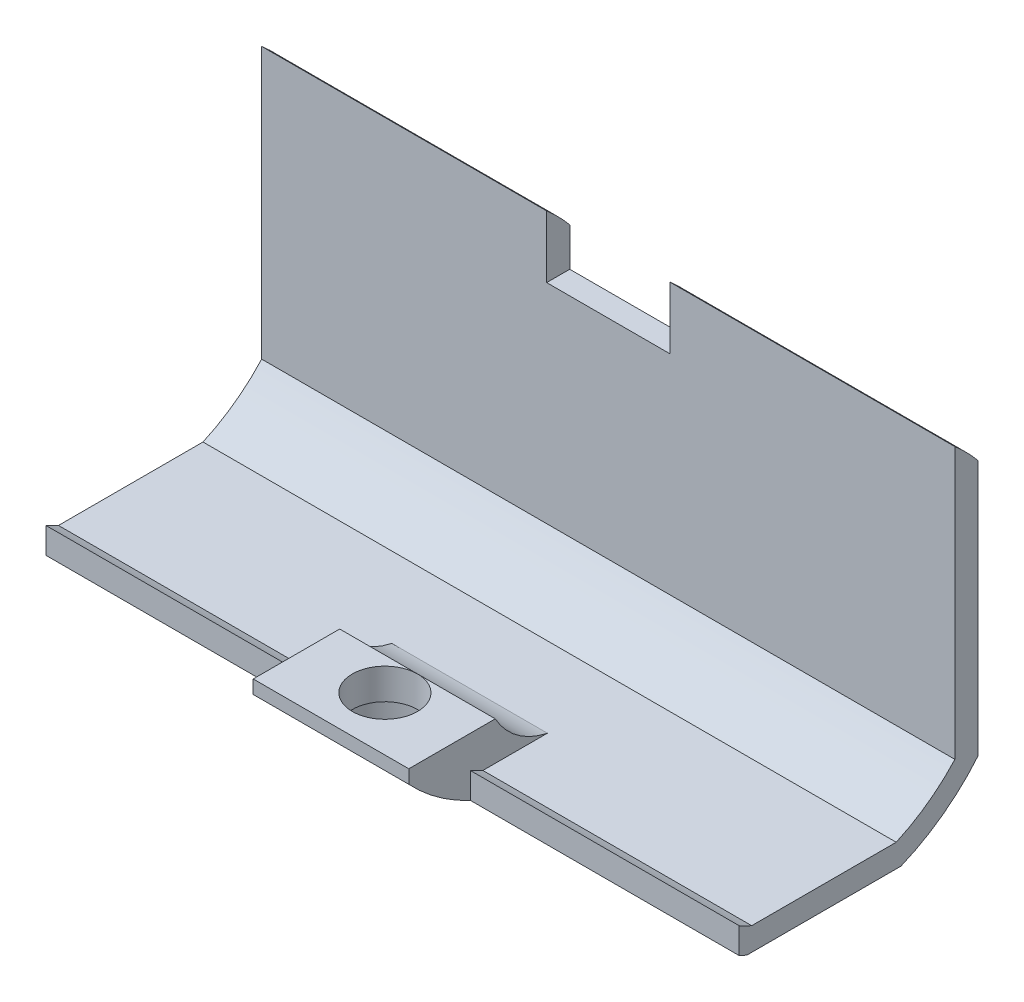
ISO-10303-21;
HEADER;
FILE_DESCRIPTION(('STEP AP214'),'2;1');
FILE_NAME('part.step','',(''),(''),'','','');
FILE_SCHEMA(('AUTOMOTIVE_DESIGN { 1 0 10303 214 1 1 1 1 }'));
ENDSEC;
DATA;
#1=APPLICATION_CONTEXT('core data for automotive mechanical design processes');
#2=APPLICATION_PROTOCOL_DEFINITION('international standard','automotive_design',2000,#1);
#3=PRODUCT_CONTEXT('',#1,'mechanical');
#4=PRODUCT('Part','Part','',(#3));
#5=PRODUCT_RELATED_PRODUCT_CATEGORY('part','',(#4));
#6=PRODUCT_DEFINITION_FORMATION('','',#4);
#7=PRODUCT_DEFINITION_CONTEXT('part definition',#1,'design');
#8=PRODUCT_DEFINITION('design','',#6,#7);
#9=PRODUCT_DEFINITION_SHAPE('','',#8);
#10=(LENGTH_UNIT() NAMED_UNIT(*) SI_UNIT(.MILLI.,.METRE.));
#11=(NAMED_UNIT(*) PLANE_ANGLE_UNIT() SI_UNIT($,.RADIAN.));
#12=(NAMED_UNIT(*) SI_UNIT($,.STERADIAN.) SOLID_ANGLE_UNIT());
#13=UNCERTAINTY_MEASURE_WITH_UNIT(LENGTH_MEASURE(1.E-05),#10,'distance_accuracy_value','');
#14=(GEOMETRIC_REPRESENTATION_CONTEXT(3) GLOBAL_UNCERTAINTY_ASSIGNED_CONTEXT((#13)) GLOBAL_UNIT_ASSIGNED_CONTEXT((#10,
#11,#12)) REPRESENTATION_CONTEXT('',''));
#15=CARTESIAN_POINT('',(0.,0.,0.));
#16=DIRECTION('',(0.,0.,1.));
#17=DIRECTION('',(1.,0.,0.));
#18=AXIS2_PLACEMENT_3D('',#15,#16,#17);
#19=CARTESIAN_POINT('',(2.37881348329814E-13,-63.4792189913841,-4.00000000008991));
#20=DIRECTION('',(0.,1.,1.41635314587774E-12));
#21=DIRECTION('',(1.,0.,0.));
#22=AXIS2_PLACEMENT_3D('',#19,#20,#21);
#23=CYLINDRICAL_SURFACE('',#22,2.115);
#24=CARTESIAN_POINT('',(2.23706429623324E-13,-59.7000000019943,-4.00000000008456));
#25=DIRECTION('',(0.,-1.,-1.41635314587774E-12));
#26=DIRECTION('',(-1.,0.,0.));
#27=AXIS2_PLACEMENT_3D('',#24,#25,#26);
#28=CIRCLE('',#27,2.115);
#29=CARTESIAN_POINT('',(2.23779328401008E-13,-59.7000000019913,-6.11500000008456));
#30=VERTEX_POINT('',#29);
#31=EDGE_CURVE('E213',#30,#30,#28,.T.);
#32=ORIENTED_EDGE('',*,*,#31,.F.);
#33=EDGE_LOOP('',(#32));
#34=FACE_BOUND('',#33,.T.);
#35=CARTESIAN_POINT('',(2.31207936546467E-13,-61.7000000019944,-4.00000000008739));
#36=DIRECTION('',(0.,-1.,-1.41635314587774E-12));
#37=DIRECTION('',(0.,1.41635314587774E-12,-1.));
#38=AXIS2_PLACEMENT_3D('',#35,#36,#37);
#39=CIRCLE('',#38,2.115);
#40=CARTESIAN_POINT('',(2.31207936546467E-13,-61.7000000019914,-6.11500000008739));
#41=VERTEX_POINT('',#40);
#42=EDGE_CURVE('E333',#41,#41,#39,.T.);
#43=ORIENTED_EDGE('',*,*,#42,.T.);
#44=EDGE_LOOP('',(#43));
#45=FACE_BOUND('',#44,.T.);
#46=ADVANCED_FACE('F36',(#34,#45),#23,.F.);
#47=CARTESIAN_POINT('',(-22.5,-51.7000000019859,-10.0000000000732));
#48=DIRECTION('',(1.,0.,0.));
#49=DIRECTION('',(0.,-1.,-1.41635314587774E-12));
#50=AXIS2_PLACEMENT_3D('',#47,#48,#49);
#51=CYLINDRICAL_SURFACE('',#50,13.);
#52=DIRECTION('',(1.,0.,0.));
#53=VECTOR('',#52,1.);
#54=CARTESIAN_POINT('',(-22.5,-43.3933761390536,-20.0000000000615));
#55=LINE('',#54,#53);
#56=CARTESIAN_POINT('',(4.,-43.3933761390536,-20.0000000000615));
#57=VERTEX_POINT('',#56);
#58=CARTESIAN_POINT('',(22.5,-43.3933761390536,-20.0000000000615));
#59=VERTEX_POINT('',#58);
#60=EDGE_CURVE('E288',#57,#59,#55,.T.);
#61=ORIENTED_EDGE('',*,*,#60,.F.);
#62=CARTESIAN_POINT('',(4.,-51.7000000019859,-10.0000000000732));
#63=DIRECTION('',(1.,0.,0.));
#64=DIRECTION('',(0.,-1.41635314587774E-12,1.));
#65=AXIS2_PLACEMENT_3D('',#62,#63,#64);
#66=CIRCLE('',#65,13.);
#67=CARTESIAN_POINT('',(4.,-41.8638422155208,-18.5000000000593));
#68=VERTEX_POINT('',#67);
#69=EDGE_CURVE('E469',#57,#68,#66,.T.);
#70=ORIENTED_EDGE('',*,*,#69,.T.);
#71=DIRECTION('',(1.,0.,0.));
#72=VECTOR('',#71,1.);
#73=CARTESIAN_POINT('',(-22.5,-41.8638422155208,-18.5000000000593));
#74=LINE('',#73,#72);
#75=CARTESIAN_POINT('',(22.5,-41.8638422155208,-18.5000000000593));
#76=VERTEX_POINT('',#75);
#77=EDGE_CURVE('E292',#68,#76,#74,.T.);
#78=ORIENTED_EDGE('',*,*,#77,.T.);
#79=CARTESIAN_POINT('',(22.5,-51.7000000019859,-10.0000000000732));
#80=DIRECTION('',(-1.,0.,0.));
#81=DIRECTION('',(0.,1.,1.41635314587774E-12));
#82=AXIS2_PLACEMENT_3D('',#79,#80,#81);
#83=CIRCLE('',#82,13.);
#84=EDGE_CURVE('E282',#76,#59,#83,.T.);
#85=ORIENTED_EDGE('',*,*,#84,.T.);
#86=EDGE_LOOP('',(#61,#70,#78,#85));
#87=FACE_BOUND('',#86,.T.);
#88=ADVANCED_FACE('F373',(#87),#51,.T.);
#89=CARTESIAN_POINT('',(-22.5,-63.4792189913834,-4.50000000008991));
#90=DIRECTION('',(0.,1.41635314587774E-12,-1.));
#91=DIRECTION('',(1.,0.,0.));
#92=AXIS2_PLACEMENT_3D('',#89,#90,#91);
#93=PLANE('',#92);
#94=DIRECTION('',(0.,1.,1.41635314587774E-12));
#95=VECTOR('',#94,1.);
#96=CARTESIAN_POINT('',(5.04999999999999,-63.4792189913833,-4.50000000008991));
#97=LINE('',#96,#95);
#98=CARTESIAN_POINT('',(5.04999999999999,-63.4792189913834,-4.50000000008992));
#99=VERTEX_POINT('',#98);
#100=CARTESIAN_POINT('',(5.04999999999998,-61.7995049403558,-4.50000000008753));
#101=VERTEX_POINT('',#100);
#102=EDGE_CURVE('E234',#99,#101,#97,.T.);
#103=ORIENTED_EDGE('',*,*,#102,.F.);
#104=DIRECTION('',(1.,0.,0.));
#105=VECTOR('',#104,1.);
#106=CARTESIAN_POINT('',(-22.5,-63.4792189913834,-4.50000000008991));
#107=LINE('',#106,#105);
#108=CARTESIAN_POINT('',(22.5,-63.4792189913834,-4.50000000008991));
#109=VERTEX_POINT('',#108);
#110=EDGE_CURVE('E310',#99,#109,#107,.T.);
#111=ORIENTED_EDGE('',*,*,#110,.T.);
#112=DIRECTION('',(0.,1.,1.41635314587774E-12));
#113=VECTOR('',#112,1.);
#114=CARTESIAN_POINT('',(22.5,-63.4792189913834,-4.50000000008991));
#115=LINE('',#114,#113);
#116=CARTESIAN_POINT('',(22.5,-61.7995049403558,-4.50000000008753));
#117=VERTEX_POINT('',#116);
#118=EDGE_CURVE('E268',#109,#117,#115,.T.);
#119=ORIENTED_EDGE('',*,*,#118,.T.);
#120=DIRECTION('',(1.,0.,0.));
#121=VECTOR('',#120,1.);
#122=CARTESIAN_POINT('',(-22.5,-61.7995049403557,-4.50000000008753));
#123=LINE('',#122,#121);
#124=EDGE_CURVE('E306',#101,#117,#123,.T.);
#125=ORIENTED_EDGE('',*,*,#124,.F.);
#126=EDGE_LOOP('',(#103,#111,#119,#125));
#127=FACE_BOUND('',#126,.T.);
#128=ADVANCED_FACE('F419',(#127),#93,.F.);
#129=DIRECTION('',(0.,-1.,-1.41635314587774E-12));
#130=VECTOR('',#129,1.);
#131=CARTESIAN_POINT('',(-5.05000000000001,-63.4792189913834,-4.50000000008991));
#132=LINE('',#131,#130);
#133=CARTESIAN_POINT('',(-5.05000000000002,-61.7995049403557,-4.50000000008753));
#134=VERTEX_POINT('',#133);
#135=CARTESIAN_POINT('',(-5.05000000000001,-63.4792189913835,-4.50000000008991));
#136=VERTEX_POINT('',#135);
#137=EDGE_CURVE('E229',#134,#136,#132,.T.);
#138=ORIENTED_EDGE('',*,*,#137,.F.);
#139=CARTESIAN_POINT('',(-22.5,-61.7995049403557,-4.50000000008753));
#140=VERTEX_POINT('',#139);
#141=EDGE_CURVE('E307',#140,#134,#123,.T.);
#142=ORIENTED_EDGE('',*,*,#141,.F.);
#143=DIRECTION('',(0.,1.,1.41635314587774E-12));
#144=VECTOR('',#143,1.);
#145=CARTESIAN_POINT('',(-22.5,-63.4792189913834,-4.50000000008991));
#146=LINE('',#145,#144);
#147=CARTESIAN_POINT('',(-22.5,-63.4792189913834,-4.50000000008991));
#148=VERTEX_POINT('',#147);
#149=EDGE_CURVE('E245',#148,#140,#146,.T.);
#150=ORIENTED_EDGE('',*,*,#149,.F.);
#151=EDGE_CURVE('E311',#148,#136,#107,.T.);
#152=ORIENTED_EDGE('',*,*,#151,.T.);
#153=EDGE_LOOP('',(#138,#142,#150,#152));
#154=FACE_BOUND('',#153,.T.);
#155=ADVANCED_FACE('F417',(#154),#93,.F.);
#156=CARTESIAN_POINT('',(-22.5,-51.7000000019859,-10.0000000000732));
#157=DIRECTION('',(1.,0.,0.));
#158=DIRECTION('',(0.,-1.,-1.41635314587774E-12));
#159=AXIS2_PLACEMENT_3D('',#156,#157,#158);
#160=CYLINDRICAL_SURFACE('',#159,11.5);
#161=CARTESIAN_POINT('',(5.04999999999994,-51.7000000019859,-10.0000000000732));
#162=DIRECTION('',(-1.,0.,0.));
#163=DIRECTION('',(0.,1.,1.41635314587774E-12));
#164=AXIS2_PLACEMENT_3D('',#161,#162,#163);
#165=CIRCLE('',#164,11.5);
#166=CARTESIAN_POINT('',(5.04999999999999,-62.2000000019925,-5.30958424026466));
#167=VERTEX_POINT('',#166);
#168=EDGE_CURVE('E232',#101,#167,#165,.F.);
#169=ORIENTED_EDGE('',*,*,#168,.F.);
#170=ORIENTED_EDGE('',*,*,#124,.T.);
#171=CARTESIAN_POINT('',(22.5,-51.7000000019859,-10.0000000000732));
#172=DIRECTION('',(1.,0.,0.));
#173=DIRECTION('',(0.,1.,1.41635314587774E-12));
#174=AXIS2_PLACEMENT_3D('',#171,#172,#173);
#175=CIRCLE('',#174,11.5);
#176=CARTESIAN_POINT('',(22.5,-62.2000000019925,-5.30958424026466));
#177=VERTEX_POINT('',#176);
#178=EDGE_CURVE('E271',#117,#177,#175,.T.);
#179=ORIENTED_EDGE('',*,*,#178,.T.);
#180=DIRECTION('',(1.,0.,0.));
#181=VECTOR('',#180,1.);
#182=CARTESIAN_POINT('',(-22.5,-62.2000000019925,-5.30958424026466));
#183=LINE('',#182,#181);
#184=EDGE_CURVE('E302',#167,#177,#183,.T.);
#185=ORIENTED_EDGE('',*,*,#184,.F.);
#186=EDGE_LOOP('',(#169,#170,#179,#185));
#187=FACE_BOUND('',#186,.T.);
#188=ADVANCED_FACE('F415',(#187),#160,.F.);
#189=CARTESIAN_POINT('',(-5.05000000000006,-51.7000000019859,-10.0000000000732));
#190=DIRECTION('',(1.,0.,0.));
#191=DIRECTION('',(0.,-1.,-1.41635314587774E-12));
#192=AXIS2_PLACEMENT_3D('',#189,#190,#191);
#193=CIRCLE('',#192,11.5);
#194=CARTESIAN_POINT('',(-5.05000000000002,-62.2000000019925,-5.30958424026466));
#195=VERTEX_POINT('',#194);
#196=EDGE_CURVE('E227',#195,#134,#193,.F.);
#197=ORIENTED_EDGE('',*,*,#196,.F.);
#198=CARTESIAN_POINT('',(-22.5,-62.2000000019925,-5.30958424026466));
#199=VERTEX_POINT('',#198);
#200=EDGE_CURVE('E303',#199,#195,#183,.T.);
#201=ORIENTED_EDGE('',*,*,#200,.F.);
#202=CARTESIAN_POINT('',(-22.5,-51.7000000019859,-10.0000000000732));
#203=DIRECTION('',(1.,0.,0.));
#204=DIRECTION('',(0.,1.,1.41635314587774E-12));
#205=AXIS2_PLACEMENT_3D('',#202,#203,#204);
#206=CIRCLE('',#205,11.5);
#207=EDGE_CURVE('E247',#140,#199,#206,.T.);
#208=ORIENTED_EDGE('',*,*,#207,.F.);
#209=ORIENTED_EDGE('',*,*,#141,.T.);
#210=EDGE_LOOP('',(#197,#201,#208,#209));
#211=FACE_BOUND('',#210,.T.);
#212=ADVANCED_FACE('F413',(#211),#160,.F.);
#213=CARTESIAN_POINT('',(-22.5,-62.2000000019792,-14.6904157599115));
#214=DIRECTION('',(0.,-1.,-1.41635314587774E-12));
#215=DIRECTION('',(-1.,0.,0.));
#216=AXIS2_PLACEMENT_3D('',#213,#214,#215);
#217=PLANE('',#216);
#218=DIRECTION('',(0.,1.41635314587774E-12,-1.));
#219=VECTOR('',#218,1.);
#220=CARTESIAN_POINT('',(5.04999999999999,-62.2000000019792,-14.6904157599115));
#221=LINE('',#220,#219);
#222=CARTESIAN_POINT('',(5.04999999999952,-62.2000000019866,-9.5000000000881));
#223=VERTEX_POINT('',#222);
#224=EDGE_CURVE('E205',#167,#223,#221,.T.);
#225=ORIENTED_EDGE('',*,*,#224,.F.);
#226=ORIENTED_EDGE('',*,*,#184,.T.);
#227=DIRECTION('',(0.,1.41635314587774E-12,-1.));
#228=VECTOR('',#227,1.);
#229=CARTESIAN_POINT('',(22.5,-62.2000000019792,-14.6904157599115));
#230=LINE('',#229,#228);
#231=CARTESIAN_POINT('',(22.5,-62.2000000019792,-14.6904157599115));
#232=VERTEX_POINT('',#231);
#233=EDGE_CURVE('E274',#177,#232,#230,.T.);
#234=ORIENTED_EDGE('',*,*,#233,.T.);
#235=DIRECTION('',(1.,0.,0.));
#236=VECTOR('',#235,1.);
#237=CARTESIAN_POINT('',(-22.5,-62.2000000019792,-14.6904157599115));
#238=LINE('',#237,#236);
#239=CARTESIAN_POINT('',(-22.5,-62.2000000019792,-14.6904157599115));
#240=VERTEX_POINT('',#239);
#241=EDGE_CURVE('E299',#240,#232,#238,.T.);
#242=ORIENTED_EDGE('',*,*,#241,.F.);
#243=DIRECTION('',(0.,1.41635314587774E-12,-1.));
#244=VECTOR('',#243,1.);
#245=CARTESIAN_POINT('',(-22.5,-62.2000000019792,-14.6904157599115));
#246=LINE('',#245,#244);
#247=EDGE_CURVE('E249',#199,#240,#246,.T.);
#248=ORIENTED_EDGE('',*,*,#247,.F.);
#249=ORIENTED_EDGE('',*,*,#200,.T.);
#250=DIRECTION('',(0.,-1.41635314587774E-12,1.));
#251=VECTOR('',#250,1.);
#252=CARTESIAN_POINT('',(-5.05000000000002,-62.2000000019792,-14.6904157599115));
#253=LINE('',#252,#251);
#254=CARTESIAN_POINT('',(-5.05000000000001,-62.2000000019865,-9.5000000000881));
#255=VERTEX_POINT('',#254);
#256=EDGE_CURVE('E323',#255,#195,#253,.T.);
#257=ORIENTED_EDGE('',*,*,#256,.F.);
#258=DIRECTION('',(-1.,0.,0.));
#259=VECTOR('',#258,1.);
#260=CARTESIAN_POINT('',(-22.5,-62.2000000019866,-9.5000000000881));
#261=LINE('',#260,#259);
#262=EDGE_CURVE('E321',#223,#255,#261,.T.);
#263=ORIENTED_EDGE('',*,*,#262,.F.);
#264=EDGE_LOOP('',(#225,#226,#234,#242,#248,#249,#257,#263));
#265=FACE_BOUND('',#264,.T.);
#266=ADVANCED_FACE('F410',(#265),#217,.F.);
#267=CARTESIAN_POINT('',(-22.5,-51.7000000019859,-10.0000000000732));
#268=DIRECTION('',(1.,0.,0.));
#269=DIRECTION('',(0.,-1.,-1.41635314587774E-12));
#270=AXIS2_PLACEMENT_3D('',#267,#268,#269);
#271=CYLINDRICAL_SURFACE('',#270,13.);
#272=CARTESIAN_POINT('',(22.5,-51.7000000019859,-10.0000000000732));
#273=DIRECTION('',(-1.,0.,0.));
#274=DIRECTION('',(0.,1.,1.41635314587774E-12));
#275=AXIS2_PLACEMENT_3D('',#272,#273,#274);
#276=CIRCLE('',#275,13.);
#277=CARTESIAN_POINT('',(22.5,-60.0066238648898,-20.000000000085));
#278=VERTEX_POINT('',#277);
#279=CARTESIAN_POINT('',(22.5,-63.7000000019788,-15.0000000000902));
#280=VERTEX_POINT('',#279);
#281=EDGE_CURVE('E236',#278,#280,#276,.T.);
#282=ORIENTED_EDGE('',*,*,#281,.T.);
#283=DIRECTION('',(1.,0.,0.));
#284=VECTOR('',#283,1.);
#285=CARTESIAN_POINT('',(-22.5,-63.7000000019788,-15.0000000000902));
#286=LINE('',#285,#284);
#287=CARTESIAN_POINT('',(-22.5,-63.7000000019788,-15.0000000000902));
#288=VERTEX_POINT('',#287);
#289=EDGE_CURVE('E318',#288,#280,#286,.T.);
#290=ORIENTED_EDGE('',*,*,#289,.F.);
#291=CARTESIAN_POINT('',(-22.5,-51.7000000019859,-10.0000000000732));
#292=DIRECTION('',(-1.,0.,0.));
#293=DIRECTION('',(0.,1.,1.41635314587774E-12));
#294=AXIS2_PLACEMENT_3D('',#291,#292,#293);
#295=CIRCLE('',#294,13.);
#296=CARTESIAN_POINT('',(-22.5,-60.0066238648898,-20.000000000085));
#297=VERTEX_POINT('',#296);
#298=EDGE_CURVE('E237',#297,#288,#295,.T.);
#299=ORIENTED_EDGE('',*,*,#298,.F.);
#300=DIRECTION('',(1.,0.,0.));
#301=VECTOR('',#300,1.);
#302=CARTESIAN_POINT('',(-22.5,-60.0066238648898,-20.000000000085));
#303=LINE('',#302,#301);
#304=EDGE_CURVE('E259',#297,#278,#303,.T.);
#305=ORIENTED_EDGE('',*,*,#304,.T.);
#306=EDGE_LOOP('',(#282,#290,#299,#305));
#307=FACE_BOUND('',#306,.T.);
#308=ADVANCED_FACE('F38',(#307),#271,.T.);
#309=CARTESIAN_POINT('',(-22.5,-63.7000000019788,-15.0000000000902));
#310=DIRECTION('',(0.,1.,1.41635314587774E-12));
#311=DIRECTION('',(1.,0.,0.));
#312=AXIS2_PLACEMENT_3D('',#309,#310,#311);
#313=PLANE('',#312);
#314=DIRECTION('',(1.,0.,0.));
#315=VECTOR('',#314,1.);
#316=CARTESIAN_POINT('',(-22.5,-63.700000001993,-5.00000000009022));
#317=LINE('',#316,#315);
#318=CARTESIAN_POINT('',(3.35410196624992,-63.700000001993,-5.00000000009024));
#319=VERTEX_POINT('',#318);
#320=CARTESIAN_POINT('',(22.5,-63.700000001993,-5.00000000009022));
#321=VERTEX_POINT('',#320);
#322=EDGE_CURVE('E314',#319,#321,#317,.T.);
#323=ORIENTED_EDGE('',*,*,#322,.F.);
#324=CARTESIAN_POINT('',(2.37431225488313E-13,-63.7000000019944,-4.00000000009022));
#325=DIRECTION('',(0.,-1.,-1.41635314587774E-12));
#326=DIRECTION('',(0.,1.41635314587774E-12,-1.));
#327=AXIS2_PLACEMENT_3D('',#324,#325,#326);
#328=CIRCLE('',#327,3.5);
#329=CARTESIAN_POINT('',(-3.35410196624944,-63.700000001993,-5.00000000009024));
#330=VERTEX_POINT('',#329);
#331=EDGE_CURVE('E444',#330,#319,#328,.T.);
#332=ORIENTED_EDGE('',*,*,#331,.F.);
#333=CARTESIAN_POINT('',(-22.5,-63.700000001993,-5.00000000009022));
#334=VERTEX_POINT('',#333);
#335=EDGE_CURVE('E315',#334,#330,#317,.T.);
#336=ORIENTED_EDGE('',*,*,#335,.F.);
#337=DIRECTION('',(0.,-1.41635314587774E-12,1.));
#338=VECTOR('',#337,1.);
#339=CARTESIAN_POINT('',(-22.5,-63.7000000019788,-15.0000000000902));
#340=LINE('',#339,#338);
#341=EDGE_CURVE('E240',#288,#334,#340,.T.);
#342=ORIENTED_EDGE('',*,*,#341,.F.);
#343=ORIENTED_EDGE('',*,*,#289,.T.);
#344=DIRECTION('',(0.,-1.41635314587774E-12,1.));
#345=VECTOR('',#344,1.);
#346=CARTESIAN_POINT('',(22.5,-63.7000000019788,-15.0000000000902));
#347=LINE('',#346,#345);
#348=EDGE_CURVE('E262',#280,#321,#347,.T.);
#349=ORIENTED_EDGE('',*,*,#348,.T.);
#350=EDGE_LOOP('',(#323,#332,#336,#342,#343,#349));
#351=FACE_BOUND('',#350,.T.);
#352=ADVANCED_FACE('F489',(#351),#313,.F.);
#353=CARTESIAN_POINT('',(-22.5,-51.7000000019859,-10.0000000000732));
#354=DIRECTION('',(1.,0.,0.));
#355=DIRECTION('',(0.,-1.,-1.41635314587774E-12));
#356=AXIS2_PLACEMENT_3D('',#353,#354,#355);
#357=CYLINDRICAL_SURFACE('',#356,13.);
#358=ORIENTED_EDGE('',*,*,#335,.T.);
#359=CARTESIAN_POINT('',(-3.35410196624945,-63.700000001993,-5.00000000009021));
#360=CARTESIAN_POINT('',(-3.38491252068896,-63.6569758293769,-4.8966993478477));
#361=CARTESIAN_POINT('',(-3.41070285458632,-63.6120725182519,-4.79272912451755));
#362=CARTESIAN_POINT('',(-3.45248580917942,-63.5188318929799,-4.58445692628003));
#363=CARTESIAN_POINT('',(-3.46848619739377,-63.4704973353184,-4.48015528055376));
#364=CARTESIAN_POINT('',(-3.49091383660567,-63.3709434121477,-4.27267369589358));
#365=CARTESIAN_POINT('',(-3.49739694535936,-63.3197427249463,-4.16949076885916));
#366=CARTESIAN_POINT('',(-3.50132254448056,-63.2145466039672,-3.96439540080032));
#367=CARTESIAN_POINT('',(-3.49876339208037,-63.1605506641134,-3.86248319401147));
#368=CARTESIAN_POINT('',(-3.47812307715941,-62.9952825831939,-3.56035821140889));
#369=CARTESIAN_POINT('',(-3.44716245054076,-62.8803279101556,-3.36291940305222));
#370=CARTESIAN_POINT('',(-3.35373600695524,-62.643613552784,-2.97943749935646));
#371=CARTESIAN_POINT('',(-3.2911971584328,-62.5218386783289,-2.79342194644323));
#372=CARTESIAN_POINT('',(-3.17800990863783,-62.3405406276482,-2.53077044469164));
#373=CARTESIAN_POINT('',(-3.13857360776398,-62.2821653939529,-2.44832941766656));
#374=CARTESIAN_POINT('',(-3.0534768913529,-62.1651097445003,-2.28693313253666));
#375=CARTESIAN_POINT('',(-3.00781683964089,-62.1064293467749,-2.20797767103113));
#376=CARTESIAN_POINT('',(-2.91062412061863,-61.9894115198998,-2.05410089198643));
#377=CARTESIAN_POINT('',(-2.85911447514484,-61.931073635589,-1.97916535911211));
#378=CARTESIAN_POINT('',(-2.75017218317155,-61.8149814250521,-1.83324545548336));
#379=CARTESIAN_POINT('',(-2.69273923314477,-61.7572271288974,-1.76226128749558));
#380=CARTESIAN_POINT('',(-2.63239175561231,-61.7000000019976,-1.69337613716932));
#381=B_SPLINE_CURVE_WITH_KNOTS('',3,(#359,#360,#361,#362,#363,#364,#365,#366,#367,#368,#369,
#370,#371,#372,#373,#374,#375,#376,#377,#378,#379,#380),.UNSPECIFIED.,.F.,.F.,(4,2,2,2,2,2,2,2,
2,2,4),(0.,0.348015125324274,0.695753769927061,1.04144323104221,1.38719549908865,
2.07593401060846,2.76627272681063,3.09140683316815,3.41652194112732,3.74039917769107,
4.064293018916),.UNSPECIFIED.);
#382=CARTESIAN_POINT('',(-2.63239175561231,-61.7000000019976,-1.69337613716932));
#383=VERTEX_POINT('',#382);
#384=EDGE_CURVE('E44',#330,#383,#381,.T.);
#385=ORIENTED_EDGE('',*,*,#384,.T.);
#386=DIRECTION('',(1.,0.,0.));
#387=VECTOR('',#386,1.);
#388=CARTESIAN_POINT('',(-22.5,-61.7000000019976,-1.69337613716932));
#389=LINE('',#388,#387);
#390=CARTESIAN_POINT('',(2.63239175561279,-61.7000000019976,-1.69337613716932));
#391=VERTEX_POINT('',#390);
#392=EDGE_CURVE('E336',#391,#383,#389,.F.);
#393=ORIENTED_EDGE('',*,*,#392,.F.);
#394=CARTESIAN_POINT('',(2.63239175561279,-61.7000000019976,-1.69337613716932));
#395=CARTESIAN_POINT('',(2.71533881428773,-61.7786958631049,-1.78808443114279));
#396=CARTESIAN_POINT('',(2.79280764752567,-61.858360878937,-1.88675639822535));
#397=CARTESIAN_POINT('',(2.93651227021488,-62.018500520216,-2.09144135323417));
#398=CARTESIAN_POINT('',(3.00274363633717,-62.0989754513221,-2.19745720886952));
#399=CARTESIAN_POINT('',(3.12414402446908,-62.2602238725767,-2.41709623076866));
#400=CARTESIAN_POINT('',(3.17921440260359,-62.3409941011769,-2.53077631792935));
#401=CARTESIAN_POINT('',(3.27703449422112,-62.5011122668419,-2.76425599499384));
#402=CARTESIAN_POINT('',(3.31978661097743,-62.5804604785033,-2.88405438584975));
#403=CARTESIAN_POINT('',(3.38950873491192,-62.7307702689552,-3.1195856921198));
#404=CARTESIAN_POINT('',(3.41744002525183,-62.8019073551935,-3.23492208641019));
#405=CARTESIAN_POINT('',(3.46160552687064,-62.9414462745329,-3.46941889441829));
#406=CARTESIAN_POINT('',(3.47784189770421,-63.0098486104218,-3.58857859788616));
#407=CARTESIAN_POINT('',(3.49790174856931,-63.1428938501131,-3.82918347515105));
#408=CARTESIAN_POINT('',(3.50179086614858,-63.2075548331262,-3.95061310017495));
#409=CARTESIAN_POINT('',(3.49669038009801,-63.332846110785,-4.19519589601303));
#410=CARTESIAN_POINT('',(3.487709955639,-63.3934792460175,-4.31834777641137));
#411=CARTESIAN_POINT('',(3.46015914911853,-63.4959044147175,-4.53490506952927));
#412=CARTESIAN_POINT('',(3.44447114093253,-63.5386778325757,-4.62821974898995));
#413=CARTESIAN_POINT('',(3.40523400364699,-63.6214686292657,-4.81453437700979));
#414=CARTESIAN_POINT('',(3.38167673319383,-63.6614831018196,-4.90753389843999));
#415=CARTESIAN_POINT('',(3.35410196624992,-63.700000001993,-5.00000000009021));
#416=B_SPLINE_CURVE_WITH_KNOTS('',3,(#394,#395,#396,#397,#398,#399,#400,#401,#402,#403,#404,
#405,#406,#407,#408,#409,#410,#411,#412,#413,#414,#415),.UNSPECIFIED.,.F.,.F.,(4,2,2,2,2,2,2,2,
2,2,4),(0.,0.445223228225198,0.890621302154366,1.33979900063259,1.7888890058229,
2.20342163049387,2.61787768896709,3.03012679274446,3.44208200711304,3.75329127187872,
4.06482350877599),.UNSPECIFIED.);
#417=EDGE_CURVE('E332',#391,#319,#416,.T.);
#418=ORIENTED_EDGE('',*,*,#417,.T.);
#419=ORIENTED_EDGE('',*,*,#322,.T.);
#420=CARTESIAN_POINT('',(22.5,-51.7000000019859,-10.0000000000732));
#421=DIRECTION('',(-1.,0.,0.));
#422=DIRECTION('',(0.,1.,1.41635314587774E-12));
#423=AXIS2_PLACEMENT_3D('',#420,#421,#422);
#424=CIRCLE('',#423,13.);
#425=EDGE_CURVE('E265',#321,#109,#424,.T.);
#426=ORIENTED_EDGE('',*,*,#425,.T.);
#427=ORIENTED_EDGE('',*,*,#110,.F.);
#428=CARTESIAN_POINT('',(5.04999999999995,-51.7000000019859,-10.0000000000732));
#429=DIRECTION('',(-1.,0.,0.));
#430=DIRECTION('',(0.,-1.,-1.41635314587774E-12));
#431=AXIS2_PLACEMENT_3D('',#428,#429,#430);
#432=CIRCLE('',#431,13.);
#433=CARTESIAN_POINT('',(5.04999999999998,-60.5741196766488,-0.500000000085794));
#434=VERTEX_POINT('',#433);
#435=EDGE_CURVE('E433',#99,#434,#432,.T.);
#436=ORIENTED_EDGE('',*,*,#435,.T.);
#437=DIRECTION('',(1.,0.,0.));
#438=VECTOR('',#437,1.);
#439=CARTESIAN_POINT('',(-12.5104007304244,-60.5741196766488,-0.500000000085798));
#440=LINE('',#439,#438);
#441=CARTESIAN_POINT('',(-5.05000000000002,-60.5741196766488,-0.500000000085798));
#442=VERTEX_POINT('',#441);
#443=EDGE_CURVE('E326',#442,#434,#440,.T.);
#444=ORIENTED_EDGE('',*,*,#443,.F.);
#445=CARTESIAN_POINT('',(-5.05000000000005,-51.7000000019859,-10.0000000000732));
#446=DIRECTION('',(1.,0.,0.));
#447=DIRECTION('',(0.,-1.,-1.41635314587774E-12));
#448=AXIS2_PLACEMENT_3D('',#445,#446,#447);
#449=CIRCLE('',#448,13.);
#450=EDGE_CURVE('E217',#442,#136,#449,.T.);
#451=ORIENTED_EDGE('',*,*,#450,.T.);
#452=ORIENTED_EDGE('',*,*,#151,.F.);
#453=CARTESIAN_POINT('',(-22.5,-51.7000000019859,-10.0000000000732));
#454=DIRECTION('',(-1.,0.,0.));
#455=DIRECTION('',(0.,1.,1.41635314587774E-12));
#456=AXIS2_PLACEMENT_3D('',#453,#454,#455);
#457=CIRCLE('',#456,13.);
#458=EDGE_CURVE('E243',#334,#148,#457,.T.);
#459=ORIENTED_EDGE('',*,*,#458,.F.);
#460=EDGE_LOOP('',(#358,#385,#393,#418,#419,#426,#427,#436,#444,#451,#452,#459));
#461=FACE_BOUND('',#460,.T.);
#462=ADVANCED_FACE('F346',(#461),#357,.T.);
#463=CARTESIAN_POINT('',(-22.5,-51.7000000019859,-10.0000000000732));
#464=DIRECTION('',(1.,0.,0.));
#465=DIRECTION('',(0.,-1.,-1.41635314587774E-12));
#466=AXIS2_PLACEMENT_3D('',#463,#464,#465);
#467=CYLINDRICAL_SURFACE('',#466,11.5);
#468=CARTESIAN_POINT('',(22.5,-51.7000000019859,-10.0000000000732));
#469=DIRECTION('',(1.,0.,0.));
#470=DIRECTION('',(0.,1.,1.41635314587774E-12));
#471=AXIS2_PLACEMENT_3D('',#468,#469,#470);
#472=CIRCLE('',#471,11.5);
#473=CARTESIAN_POINT('',(22.5,-59.4459666943887,-18.5000000000842));
#474=VERTEX_POINT('',#473);
#475=EDGE_CURVE('E276',#232,#474,#472,.T.);
#476=ORIENTED_EDGE('',*,*,#475,.T.);
#477=DIRECTION('',(1.,0.,0.));
#478=VECTOR('',#477,1.);
#479=CARTESIAN_POINT('',(-22.5,-59.4459666943887,-18.5000000000842));
#480=LINE('',#479,#478);
#481=CARTESIAN_POINT('',(-22.5,-59.4459666943887,-18.5000000000842));
#482=VERTEX_POINT('',#481);
#483=EDGE_CURVE('E296',#482,#474,#480,.T.);
#484=ORIENTED_EDGE('',*,*,#483,.F.);
#485=CARTESIAN_POINT('',(-22.5,-51.7000000019859,-10.0000000000732));
#486=DIRECTION('',(1.,0.,0.));
#487=DIRECTION('',(0.,1.,1.41635314587774E-12));
#488=AXIS2_PLACEMENT_3D('',#485,#486,#487);
#489=CIRCLE('',#488,11.5);
#490=EDGE_CURVE('E251',#240,#482,#489,.T.);
#491=ORIENTED_EDGE('',*,*,#490,.F.);
#492=ORIENTED_EDGE('',*,*,#241,.T.);
#493=EDGE_LOOP('',(#476,#484,#491,#492));
#494=FACE_BOUND('',#493,.T.);
#495=ADVANCED_FACE('F405',(#494),#467,.F.);
#496=CARTESIAN_POINT('',(-22.5,-43.954033309559,-18.5000000000623));
#497=DIRECTION('',(0.,1.41635314587774E-12,-1.));
#498=DIRECTION('',(1.,0.,0.));
#499=AXIS2_PLACEMENT_3D('',#496,#497,#498);
#500=PLANE('',#499);
#501=ORIENTED_EDGE('',*,*,#77,.F.);
#502=DIRECTION('',(0.,-1.,-1.41635314587774E-12));
#503=VECTOR('',#502,1.);
#504=CARTESIAN_POINT('',(4.,-43.954033309559,-18.5000000000623));
#505=LINE('',#504,#503);
#506=CARTESIAN_POINT('',(4.,-45.8933761390558,-18.500000000065));
#507=VERTEX_POINT('',#506);
#508=EDGE_CURVE('E472',#68,#507,#505,.T.);
#509=ORIENTED_EDGE('',*,*,#508,.T.);
#510=DIRECTION('',(-1.,0.,0.));
#511=VECTOR('',#510,1.);
#512=CARTESIAN_POINT('',(-22.5,-45.8933761390558,-18.500000000065));
#513=LINE('',#512,#511);
#514=CARTESIAN_POINT('',(-4.,-45.8933761390558,-18.500000000065));
#515=VERTEX_POINT('',#514);
#516=EDGE_CURVE('E459',#507,#515,#513,.T.);
#517=ORIENTED_EDGE('',*,*,#516,.T.);
#518=DIRECTION('',(0.,1.,1.41635314587774E-12));
#519=VECTOR('',#518,1.);
#520=CARTESIAN_POINT('',(-4.,-43.954033309559,-18.5000000000623));
#521=LINE('',#520,#519);
#522=CARTESIAN_POINT('',(-4.,-41.8638422155208,-18.5000000000593));
#523=VERTEX_POINT('',#522);
#524=EDGE_CURVE('E466',#515,#523,#521,.T.);
#525=ORIENTED_EDGE('',*,*,#524,.T.);
#526=CARTESIAN_POINT('',(-22.5,-41.8638422155208,-18.5000000000593));
#527=VERTEX_POINT('',#526);
#528=EDGE_CURVE('E293',#527,#523,#74,.T.);
#529=ORIENTED_EDGE('',*,*,#528,.F.);
#530=DIRECTION('',(0.,1.,1.41635314587774E-12));
#531=VECTOR('',#530,1.);
#532=CARTESIAN_POINT('',(-22.5,-43.954033309559,-18.5000000000623));
#533=LINE('',#532,#531);
#534=EDGE_CURVE('E253',#482,#527,#533,.T.);
#535=ORIENTED_EDGE('',*,*,#534,.F.);
#536=ORIENTED_EDGE('',*,*,#483,.T.);
#537=DIRECTION('',(0.,1.,1.41635314587774E-12));
#538=VECTOR('',#537,1.);
#539=CARTESIAN_POINT('',(22.5,-43.954033309559,-18.5000000000623));
#540=LINE('',#539,#538);
#541=EDGE_CURVE('E279',#474,#76,#540,.T.);
#542=ORIENTED_EDGE('',*,*,#541,.T.);
#543=EDGE_LOOP('',(#501,#509,#517,#525,#529,#535,#536,#542));
#544=FACE_BOUND('',#543,.T.);
#545=ADVANCED_FACE('F401',(#544),#500,.F.);
#546=ORIENTED_EDGE('',*,*,#528,.T.);
#547=CARTESIAN_POINT('',(-4.,-51.7000000019859,-10.0000000000732));
#548=DIRECTION('',(-1.,0.,0.));
#549=DIRECTION('',(0.,1.41635314587774E-12,-1.));
#550=AXIS2_PLACEMENT_3D('',#547,#548,#549);
#551=CIRCLE('',#550,13.);
#552=CARTESIAN_POINT('',(-4.,-43.3933761390536,-20.0000000000615));
#553=VERTEX_POINT('',#552);
#554=EDGE_CURVE('E463',#523,#553,#551,.T.);
#555=ORIENTED_EDGE('',*,*,#554,.T.);
#556=CARTESIAN_POINT('',(-22.5,-43.3933761390536,-20.0000000000615));
#557=VERTEX_POINT('',#556);
#558=EDGE_CURVE('E289',#557,#553,#55,.T.);
#559=ORIENTED_EDGE('',*,*,#558,.F.);
#560=CARTESIAN_POINT('',(-22.5,-51.7000000019859,-10.0000000000732));
#561=DIRECTION('',(-1.,0.,0.));
#562=DIRECTION('',(0.,1.,1.41635314587774E-12));
#563=AXIS2_PLACEMENT_3D('',#560,#561,#562);
#564=CIRCLE('',#563,13.);
#565=EDGE_CURVE('E255',#527,#557,#564,.T.);
#566=ORIENTED_EDGE('',*,*,#565,.F.);
#567=EDGE_LOOP('',(#546,#555,#559,#566));
#568=FACE_BOUND('',#567,.T.);
#569=ADVANCED_FACE('F397',(#568),#51,.T.);
#570=CARTESIAN_POINT('',(-22.5,-43.3933761390536,-20.0000000000615));
#571=DIRECTION('',(0.,-1.41635314587774E-12,1.));
#572=DIRECTION('',(-1.,0.,0.));
#573=AXIS2_PLACEMENT_3D('',#570,#571,#572);
#574=PLANE('',#573);
#575=DIRECTION('',(-1.,0.,0.));
#576=VECTOR('',#575,1.);
#577=CARTESIAN_POINT('',(-4.,-45.8933761390536,-20.000000000065));
#578=LINE('',#577,#576);
#579=CARTESIAN_POINT('',(4.,-45.8933761390536,-20.000000000065));
#580=VERTEX_POINT('',#579);
#581=CARTESIAN_POINT('',(-4.,-45.8933761390536,-20.000000000065));
#582=VERTEX_POINT('',#581);
#583=EDGE_CURVE('E451',#580,#582,#578,.T.);
#584=ORIENTED_EDGE('',*,*,#583,.F.);
#585=DIRECTION('',(0.,1.,1.41635314587774E-12));
#586=VECTOR('',#585,1.);
#587=CARTESIAN_POINT('',(4.,-43.3933761390536,-20.0000000000615));
#588=LINE('',#587,#586);
#589=EDGE_CURVE('E329',#580,#57,#588,.T.);
#590=ORIENTED_EDGE('',*,*,#589,.T.);
#591=ORIENTED_EDGE('',*,*,#60,.T.);
#592=DIRECTION('',(0.,-1.,-1.41635314587774E-12));
#593=VECTOR('',#592,1.);
#594=CARTESIAN_POINT('',(22.5,-43.3933761390536,-20.0000000000615));
#595=LINE('',#594,#593);
#596=EDGE_CURVE('E241',#59,#278,#595,.T.);
#597=ORIENTED_EDGE('',*,*,#596,.T.);
#598=ORIENTED_EDGE('',*,*,#304,.F.);
#599=DIRECTION('',(0.,-1.,-1.41635314587774E-12));
#600=VECTOR('',#599,1.);
#601=CARTESIAN_POINT('',(-22.5,-43.3933761390536,-20.0000000000615));
#602=LINE('',#601,#600);
#603=EDGE_CURVE('E257',#557,#297,#602,.T.);
#604=ORIENTED_EDGE('',*,*,#603,.F.);
#605=ORIENTED_EDGE('',*,*,#558,.T.);
#606=DIRECTION('',(0.,1.,1.41635314587774E-12));
#607=VECTOR('',#606,1.);
#608=CARTESIAN_POINT('',(-4.,-37.8131922452188,-20.0000000000536));
#609=LINE('',#608,#607);
#610=EDGE_CURVE('E454',#582,#553,#609,.T.);
#611=ORIENTED_EDGE('',*,*,#610,.F.);
#612=EDGE_LOOP('',(#584,#590,#591,#597,#598,#604,#605,#611));
#613=FACE_BOUND('',#612,.T.);
#614=ADVANCED_FACE('F390',(#613),#574,.F.);
#615=CARTESIAN_POINT('',(-22.5,-51.7000000019859,-10.0000000000732));
#616=DIRECTION('',(-1.,0.,0.));
#617=DIRECTION('',(0.,1.,1.41635314587774E-12));
#618=AXIS2_PLACEMENT_3D('',#615,#616,#617);
#619=PLANE('',#618);
#620=ORIENTED_EDGE('',*,*,#298,.T.);
#621=ORIENTED_EDGE('',*,*,#341,.T.);
#622=ORIENTED_EDGE('',*,*,#458,.T.);
#623=ORIENTED_EDGE('',*,*,#149,.T.);
#624=ORIENTED_EDGE('',*,*,#207,.T.);
#625=ORIENTED_EDGE('',*,*,#247,.T.);
#626=ORIENTED_EDGE('',*,*,#490,.T.);
#627=ORIENTED_EDGE('',*,*,#534,.T.);
#628=ORIENTED_EDGE('',*,*,#565,.T.);
#629=ORIENTED_EDGE('',*,*,#603,.T.);
#630=EDGE_LOOP('',(#620,#621,#622,#623,#624,#625,#626,#627,#628,#629));
#631=FACE_BOUND('',#630,.T.);
#632=ADVANCED_FACE('F387',(#631),#619,.T.);
#633=CARTESIAN_POINT('',(22.5,-51.7000000019859,-10.0000000000732));
#634=DIRECTION('',(-1.,0.,0.));
#635=DIRECTION('',(0.,1.,1.41635314587774E-12));
#636=AXIS2_PLACEMENT_3D('',#633,#634,#635);
#637=PLANE('',#636);
#638=ORIENTED_EDGE('',*,*,#281,.F.);
#639=ORIENTED_EDGE('',*,*,#596,.F.);
#640=ORIENTED_EDGE('',*,*,#84,.F.);
#641=ORIENTED_EDGE('',*,*,#541,.F.);
#642=ORIENTED_EDGE('',*,*,#475,.F.);
#643=ORIENTED_EDGE('',*,*,#233,.F.);
#644=ORIENTED_EDGE('',*,*,#178,.F.);
#645=ORIENTED_EDGE('',*,*,#118,.F.);
#646=ORIENTED_EDGE('',*,*,#425,.F.);
#647=ORIENTED_EDGE('',*,*,#348,.F.);
#648=EDGE_LOOP('',(#638,#639,#640,#641,#642,#643,#644,#645,#646,#647));
#649=FACE_BOUND('',#648,.T.);
#650=ADVANCED_FACE('F386',(#649),#637,.F.);
#651=CARTESIAN_POINT('',(5.04999999999999,-63.4792189913841,-4.00000000008991));
#652=DIRECTION('',(-1.,0.,0.));
#653=DIRECTION('',(0.,1.,1.41635314587774E-12));
#654=AXIS2_PLACEMENT_3D('',#651,#652,#653);
#655=PLANE('',#654);
#656=ORIENTED_EDGE('',*,*,#224,.T.);
#657=CARTESIAN_POINT('',(5.04999999999954,-57.3014577782105,-10.5021397517611));
#658=DIRECTION('',(1.,0.,0.));
#659=DIRECTION('',(0.,1.,1.41635314587774E-12));
#660=AXIS2_PLACEMENT_3D('',#657,#658,#659);
#661=CIRCLE('',#660,5.);
#662=CARTESIAN_POINT('',(5.04999999999953,-59.7000000019914,-6.11500000008456));
#663=VERTEX_POINT('',#662);
#664=EDGE_CURVE('E193',#663,#223,#661,.T.);
#665=ORIENTED_EDGE('',*,*,#664,.F.);
#666=DIRECTION('',(0.,-1.41635314587774E-12,1.));
#667=VECTOR('',#666,1.);
#668=CARTESIAN_POINT('',(5.04999999999998,-59.7000000019943,-4.00000000008456));
#669=LINE('',#668,#667);
#670=CARTESIAN_POINT('',(5.04999999999998,-59.7000000019993,-0.500000000084556));
#671=VERTEX_POINT('',#670);
#672=EDGE_CURVE('E202',#663,#671,#669,.T.);
#673=ORIENTED_EDGE('',*,*,#672,.T.);
#674=DIRECTION('',(0.,1.,1.41635314587774E-12));
#675=VECTOR('',#674,1.);
#676=CARTESIAN_POINT('',(5.04999999999999,-63.4792189913891,-0.500000000089909));
#677=LINE('',#676,#675);
#678=EDGE_CURVE('E225',#434,#671,#677,.T.);
#679=ORIENTED_EDGE('',*,*,#678,.F.);
#680=ORIENTED_EDGE('',*,*,#435,.F.);
#681=ORIENTED_EDGE('',*,*,#102,.T.);
#682=ORIENTED_EDGE('',*,*,#168,.T.);
#683=EDGE_LOOP('',(#656,#665,#673,#679,#680,#681,#682));
#684=FACE_BOUND('',#683,.T.);
#685=ADVANCED_FACE('F200',(#684),#655,.F.);
#686=CARTESIAN_POINT('',(-5.05000000000001,-63.4792189913785,-8.00000000008991));
#687=DIRECTION('',(1.,0.,0.));
#688=DIRECTION('',(0.,-1.,-1.41635314587774E-12));
#689=AXIS2_PLACEMENT_3D('',#686,#687,#688);
#690=PLANE('',#689);
#691=DIRECTION('',(0.,1.41635314587774E-12,-1.));
#692=VECTOR('',#691,1.);
#693=CARTESIAN_POINT('',(-5.05000000000002,-59.7000000019887,-8.00000000008456));
#694=LINE('',#693,#692);
#695=CARTESIAN_POINT('',(-5.05000000000002,-59.7000000019993,-0.500000000084556));
#696=VERTEX_POINT('',#695);
#697=CARTESIAN_POINT('',(-5.05000000000002,-59.7000000019914,-6.11500000008456));
#698=VERTEX_POINT('',#697);
#699=EDGE_CURVE('E215',#696,#698,#694,.T.);
#700=ORIENTED_EDGE('',*,*,#699,.T.);
#701=CARTESIAN_POINT('',(-5.05000000000003,-57.3014577782105,-10.5021397517611));
#702=DIRECTION('',(1.,0.,0.));
#703=DIRECTION('',(0.,-1.,-1.41635314587774E-12));
#704=AXIS2_PLACEMENT_3D('',#701,#702,#703);
#705=CIRCLE('',#704,5.);
#706=EDGE_CURVE('E51',#255,#698,#705,.F.);
#707=ORIENTED_EDGE('',*,*,#706,.F.);
#708=ORIENTED_EDGE('',*,*,#256,.T.);
#709=ORIENTED_EDGE('',*,*,#196,.T.);
#710=ORIENTED_EDGE('',*,*,#137,.T.);
#711=ORIENTED_EDGE('',*,*,#450,.F.);
#712=DIRECTION('',(0.,1.,1.41635314587774E-12));
#713=VECTOR('',#712,1.);
#714=CARTESIAN_POINT('',(-5.05000000000001,-63.4792189913891,-0.500000000089909));
#715=LINE('',#714,#713);
#716=EDGE_CURVE('E223',#442,#696,#715,.T.);
#717=ORIENTED_EDGE('',*,*,#716,.T.);
#718=EDGE_LOOP('',(#700,#707,#708,#709,#710,#711,#717));
#719=FACE_BOUND('',#718,.T.);
#720=ADVANCED_FACE('F377',(#719),#690,.F.);
#721=CARTESIAN_POINT('',(2.45904596013074E-13,-59.700000002,-8.45562828117335E-11));
#722=DIRECTION('',(0.,-1.,-1.41635314587774E-12));
#723=DIRECTION('',(-1.,0.,0.));
#724=AXIS2_PLACEMENT_3D('',#721,#722,#723);
#725=PLANE('',#724);
#726=ORIENTED_EDGE('',*,*,#672,.F.);
#727=DIRECTION('',(1.,0.,0.));
#728=VECTOR('',#727,1.);
#729=CARTESIAN_POINT('',(-9.25811418571315,-59.7000000019914,-6.1150000000846));
#730=LINE('',#729,#728);
#731=EDGE_CURVE('E12',#663,#30,#730,.F.);
#732=ORIENTED_EDGE('',*,*,#731,.T.);
#733=ORIENTED_EDGE('',*,*,#31,.T.);
#734=DIRECTION('',(1.,0.,0.));
#735=VECTOR('',#734,1.);
#736=CARTESIAN_POINT('',(-9.25811418571317,-59.7000000019913,-6.11500000008456));
#737=LINE('',#736,#735);
#738=EDGE_CURVE('E195',#698,#30,#737,.T.);
#739=ORIENTED_EDGE('',*,*,#738,.F.);
#740=ORIENTED_EDGE('',*,*,#699,.F.);
#741=DIRECTION('',(-1.,0.,0.));
#742=VECTOR('',#741,1.);
#743=CARTESIAN_POINT('',(5.04999999999998,-59.7000000019993,-0.500000000084556));
#744=LINE('',#743,#742);
#745=EDGE_CURVE('E212',#671,#696,#744,.T.);
#746=ORIENTED_EDGE('',*,*,#745,.F.);
#747=EDGE_LOOP('',(#726,#732,#733,#739,#740,#746));
#748=FACE_BOUND('',#747,.T.);
#749=ADVANCED_FACE('F209',(#748),#725,.F.);
#750=CARTESIAN_POINT('',(5.04999999999999,-63.4792189913891,-0.500000000089909));
#751=DIRECTION('',(0.,1.41635314587774E-12,-1.));
#752=DIRECTION('',(1.,0.,0.));
#753=AXIS2_PLACEMENT_3D('',#750,#751,#752);
#754=PLANE('',#753);
#755=ORIENTED_EDGE('',*,*,#716,.F.);
#756=ORIENTED_EDGE('',*,*,#443,.T.);
#757=ORIENTED_EDGE('',*,*,#678,.T.);
#758=ORIENTED_EDGE('',*,*,#745,.T.);
#759=EDGE_LOOP('',(#755,#756,#757,#758));
#760=FACE_BOUND('',#759,.T.);
#761=ADVANCED_FACE('F363',(#760),#754,.F.);
#762=CARTESIAN_POINT('',(4.,-45.8933761390678,-10.000000000065));
#763=DIRECTION('',(1.,0.,0.));
#764=DIRECTION('',(0.,-1.41635314587774E-12,1.));
#765=AXIS2_PLACEMENT_3D('',#762,#763,#764);
#766=PLANE('',#765);
#767=ORIENTED_EDGE('',*,*,#69,.F.);
#768=ORIENTED_EDGE('',*,*,#589,.F.);
#769=DIRECTION('',(0.,1.41635314587774E-12,-1.));
#770=VECTOR('',#769,1.);
#771=CARTESIAN_POINT('',(4.,-45.8933761390678,-10.000000000065));
#772=LINE('',#771,#770);
#773=EDGE_CURVE('E457',#507,#580,#772,.T.);
#774=ORIENTED_EDGE('',*,*,#773,.F.);
#775=ORIENTED_EDGE('',*,*,#508,.F.);
#776=EDGE_LOOP('',(#767,#768,#774,#775));
#777=FACE_BOUND('',#776,.T.);
#778=ADVANCED_FACE('F358',(#777),#766,.F.);
#779=CARTESIAN_POINT('',(-4.,-37.813192245233,-10.0000000000536));
#780=DIRECTION('',(-1.,0.,0.));
#781=DIRECTION('',(0.,1.41635314587774E-12,-1.));
#782=AXIS2_PLACEMENT_3D('',#779,#780,#781);
#783=PLANE('',#782);
#784=DIRECTION('',(0.,1.41635314587774E-12,-1.));
#785=VECTOR('',#784,1.);
#786=CARTESIAN_POINT('',(-4.,-45.8933761390678,-10.000000000065));
#787=LINE('',#786,#785);
#788=EDGE_CURVE('E456',#515,#582,#787,.T.);
#789=ORIENTED_EDGE('',*,*,#788,.T.);
#790=ORIENTED_EDGE('',*,*,#610,.T.);
#791=ORIENTED_EDGE('',*,*,#554,.F.);
#792=ORIENTED_EDGE('',*,*,#524,.F.);
#793=EDGE_LOOP('',(#789,#790,#791,#792));
#794=FACE_BOUND('',#793,.T.);
#795=ADVANCED_FACE('F362',(#794),#783,.F.);
#796=CARTESIAN_POINT('',(-4.,-45.8933761390678,-10.000000000065));
#797=DIRECTION('',(0.,-1.,-1.41635314587774E-12));
#798=DIRECTION('',(0.,1.41635314587774E-12,-1.));
#799=AXIS2_PLACEMENT_3D('',#796,#797,#798);
#800=PLANE('',#799);
#801=ORIENTED_EDGE('',*,*,#773,.T.);
#802=ORIENTED_EDGE('',*,*,#583,.T.);
#803=ORIENTED_EDGE('',*,*,#788,.F.);
#804=ORIENTED_EDGE('',*,*,#516,.F.);
#805=EDGE_LOOP('',(#801,#802,#803,#804));
#806=FACE_BOUND('',#805,.T.);
#807=ADVANCED_FACE('F355',(#806),#800,.F.);
#808=CARTESIAN_POINT('',(2.37431225488313E-13,-61.7000000019944,-4.00000000008739));
#809=DIRECTION('',(0.,-1.,-1.41635314587774E-12));
#810=DIRECTION('',(0.,1.41635314587774E-12,-1.));
#811=AXIS2_PLACEMENT_3D('',#808,#809,#810);
#812=CYLINDRICAL_SURFACE('',#811,3.5);
#813=ORIENTED_EDGE('',*,*,#331,.T.);
#814=ORIENTED_EDGE('',*,*,#417,.F.);
#815=CARTESIAN_POINT('',(2.37431225488313E-13,-61.7000000019944,-4.00000000008739));
#816=DIRECTION('',(0.,-1.,-1.41635314587774E-12));
#817=DIRECTION('',(0.,1.41635314587774E-12,-1.));
#818=AXIS2_PLACEMENT_3D('',#815,#816,#817);
#819=CIRCLE('',#818,3.5);
#820=EDGE_CURVE('E58',#383,#391,#819,.T.);
#821=ORIENTED_EDGE('',*,*,#820,.F.);
#822=ORIENTED_EDGE('',*,*,#384,.F.);
#823=EDGE_LOOP('',(#813,#814,#821,#822));
#824=FACE_BOUND('',#823,.T.);
#825=ADVANCED_FACE('F349',(#824),#812,.F.);
#826=CARTESIAN_POINT('',(2.37431225488313E-13,-61.7000000019944,-4.00000000008739));
#827=DIRECTION('',(0.,-1.,-1.41635314587774E-12));
#828=DIRECTION('',(0.,1.41635314587774E-12,-1.));
#829=AXIS2_PLACEMENT_3D('',#826,#827,#828);
#830=PLANE('',#829);
#831=ORIENTED_EDGE('',*,*,#42,.F.);
#832=EDGE_LOOP('',(#831));
#833=FACE_BOUND('',#832,.T.);
#834=ORIENTED_EDGE('',*,*,#392,.T.);
#835=ORIENTED_EDGE('',*,*,#820,.T.);
#836=EDGE_LOOP('',(#834,#835));
#837=FACE_BOUND('',#836,.T.);
#838=ADVANCED_FACE('F354',(#833,#837),#830,.T.);
#839=CARTESIAN_POINT('',(-9.25811418571316,-57.3014577782105,-10.5021397517611));
#840=DIRECTION('',(1.,0.,0.));
#841=DIRECTION('',(0.,-1.,-1.41635314587774E-12));
#842=AXIS2_PLACEMENT_3D('',#839,#840,#841);
#843=CYLINDRICAL_SURFACE('',#842,5.);
#844=ORIENTED_EDGE('',*,*,#706,.T.);
#845=ORIENTED_EDGE('',*,*,#738,.T.);
#846=ORIENTED_EDGE('',*,*,#731,.F.);
#847=ORIENTED_EDGE('',*,*,#664,.T.);
#848=ORIENTED_EDGE('',*,*,#262,.T.);
#849=EDGE_LOOP('',(#844,#845,#846,#847,#848));
#850=FACE_BOUND('',#849,.T.);
#851=ADVANCED_FACE('F192',(#850),#843,.F.);
#852=CLOSED_SHELL('',(#46,#88,#128,#155,#188,#212,#266,#308,#352,#462,#495,#545,#569,#614,#632,
#650,#685,#720,#749,#761,#778,#795,#807,#825,#838,#851));
#853=MANIFOLD_SOLID_BREP('B2',#852);
#854=ADVANCED_BREP_SHAPE_REPRESENTATION('',(#18,#853),#14);
#855=SHAPE_DEFINITION_REPRESENTATION(#9,#854);
ENDSEC;
END-ISO-10303-21;
